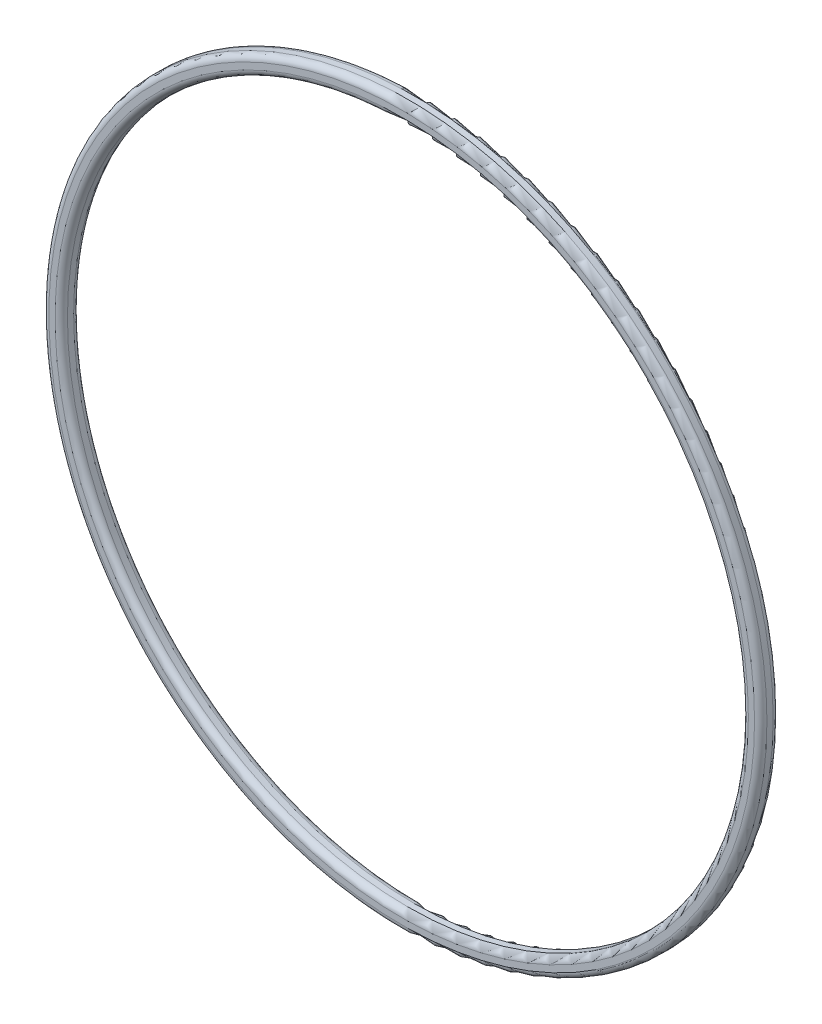
ISO-10303-21;
HEADER;
FILE_DESCRIPTION(('STEP AP214'),'2;1');
FILE_NAME('part.step','',(''),(''),'','','');
FILE_SCHEMA(('AUTOMOTIVE_DESIGN { 1 0 10303 214 1 1 1 1 }'));
ENDSEC;
DATA;
#1=APPLICATION_CONTEXT('core data for automotive mechanical design processes');
#2=APPLICATION_PROTOCOL_DEFINITION('international standard','automotive_design',2000,#1);
#3=PRODUCT_CONTEXT('',#1,'mechanical');
#4=PRODUCT('Part','Part','',(#3));
#5=PRODUCT_RELATED_PRODUCT_CATEGORY('part','',(#4));
#6=PRODUCT_DEFINITION_FORMATION('','',#4);
#7=PRODUCT_DEFINITION_CONTEXT('part definition',#1,'design');
#8=PRODUCT_DEFINITION('design','',#6,#7);
#9=PRODUCT_DEFINITION_SHAPE('','',#8);
#10=(LENGTH_UNIT() NAMED_UNIT(*) SI_UNIT(.MILLI.,.METRE.));
#11=(NAMED_UNIT(*) PLANE_ANGLE_UNIT() SI_UNIT($,.RADIAN.));
#12=(NAMED_UNIT(*) SI_UNIT($,.STERADIAN.) SOLID_ANGLE_UNIT());
#13=UNCERTAINTY_MEASURE_WITH_UNIT(LENGTH_MEASURE(1.E-05),#10,'distance_accuracy_value','');
#14=(GEOMETRIC_REPRESENTATION_CONTEXT(3) GLOBAL_UNCERTAINTY_ASSIGNED_CONTEXT((#13)) GLOBAL_UNIT_ASSIGNED_CONTEXT((#10,
#11,#12)) REPRESENTATION_CONTEXT('',''));
#15=CARTESIAN_POINT('',(0.,0.,0.));
#16=DIRECTION('',(0.,0.,1.));
#17=DIRECTION('',(1.,0.,0.));
#18=AXIS2_PLACEMENT_3D('',#15,#16,#17);
#19=CARTESIAN_POINT('',(0.,0.,3.));
#20=DIRECTION('',(0.,0.,1.));
#21=DIRECTION('',(1.,0.,0.));
#22=AXIS2_PLACEMENT_3D('',#19,#20,#21);
#23=PLANE('',#22);
#24=CARTESIAN_POINT('',(0.,0.,3.));
#25=DIRECTION('',(0.,0.,1.));
#26=DIRECTION('',(1.,0.,0.));
#27=AXIS2_PLACEMENT_3D('',#24,#25,#26);
#28=CIRCLE('',#27,56.);
#29=CARTESIAN_POINT('',(56.,0.,3.));
#30=VERTEX_POINT('',#29);
#31=EDGE_CURVE('E10',#30,#30,#28,.F.);
#32=ORIENTED_EDGE('',*,*,#31,.T.);
#33=EDGE_LOOP('',(#32));
#34=FACE_BOUND('',#33,.T.);
#35=CARTESIAN_POINT('',(0.,0.,3.));
#36=DIRECTION('',(0.,0.,1.));
#37=DIRECTION('',(1.,0.,0.));
#38=AXIS2_PLACEMENT_3D('',#35,#36,#37);
#39=CIRCLE('',#38,57.);
#40=CARTESIAN_POINT('',(57.,0.,3.));
#41=VERTEX_POINT('',#40);
#42=EDGE_CURVE('E41',#41,#41,#39,.T.);
#43=ORIENTED_EDGE('',*,*,#42,.T.);
#44=EDGE_LOOP('',(#43));
#45=FACE_BOUND('',#44,.T.);
#46=ADVANCED_FACE('F34',(#34,#45),#23,.T.);
#47=CARTESIAN_POINT('',(0.,0.,0.));
#48=DIRECTION('',(0.,0.,1.));
#49=DIRECTION('',(1.,0.,0.));
#50=AXIS2_PLACEMENT_3D('',#47,#48,#49);
#51=PLANE('',#50);
#52=CARTESIAN_POINT('',(0.,0.,0.));
#53=DIRECTION('',(0.,0.,1.));
#54=DIRECTION('',(1.,0.,0.));
#55=AXIS2_PLACEMENT_3D('',#52,#53,#54);
#56=CIRCLE('',#55,56.);
#57=CARTESIAN_POINT('',(56.,0.,0.));
#58=VERTEX_POINT('',#57);
#59=EDGE_CURVE('E60',#58,#58,#56,.T.);
#60=ORIENTED_EDGE('',*,*,#59,.T.);
#61=EDGE_LOOP('',(#60));
#62=FACE_BOUND('',#61,.T.);
#63=CARTESIAN_POINT('',(0.,0.,0.));
#64=DIRECTION('',(0.,0.,1.));
#65=DIRECTION('',(1.,0.,0.));
#66=AXIS2_PLACEMENT_3D('',#63,#64,#65);
#67=CIRCLE('',#66,57.);
#68=CARTESIAN_POINT('',(57.,0.,0.));
#69=VERTEX_POINT('',#68);
#70=EDGE_CURVE('E63',#69,#69,#67,.F.);
#71=ORIENTED_EDGE('',*,*,#70,.T.);
#72=EDGE_LOOP('',(#71));
#73=FACE_BOUND('',#72,.T.);
#74=ADVANCED_FACE('F67',(#62,#73),#51,.F.);
#75=CARTESIAN_POINT('',(0.,0.,3.));
#76=DIRECTION('',(0.,0.,-1.));
#77=DIRECTION('',(-1.,0.,0.));
#78=AXIS2_PLACEMENT_3D('',#75,#76,#77);
#79=CYLINDRICAL_SURFACE('',#78,58.);
#80=CARTESIAN_POINT('',(0.,0.,1.));
#81=DIRECTION('',(0.,0.,1.));
#82=DIRECTION('',(1.,0.,0.));
#83=AXIS2_PLACEMENT_3D('',#80,#81,#82);
#84=CIRCLE('',#83,58.);
#85=CARTESIAN_POINT('',(58.,0.,1.));
#86=VERTEX_POINT('',#85);
#87=EDGE_CURVE('E45',#86,#86,#84,.T.);
#88=ORIENTED_EDGE('',*,*,#87,.T.);
#89=EDGE_LOOP('',(#88));
#90=FACE_BOUND('',#89,.T.);
#91=CARTESIAN_POINT('',(0.,0.,2.));
#92=DIRECTION('',(0.,0.,1.));
#93=DIRECTION('',(1.,0.,0.));
#94=AXIS2_PLACEMENT_3D('',#91,#92,#93);
#95=CIRCLE('',#94,58.);
#96=CARTESIAN_POINT('',(58.,0.,2.));
#97=VERTEX_POINT('',#96);
#98=EDGE_CURVE('E49',#97,#97,#95,.F.);
#99=ORIENTED_EDGE('',*,*,#98,.T.);
#100=EDGE_LOOP('',(#99));
#101=FACE_BOUND('',#100,.T.);
#102=ADVANCED_FACE('F77',(#90,#101),#79,.T.);
#103=CARTESIAN_POINT('',(0.,0.,3.));
#104=DIRECTION('',(0.,0.,-1.));
#105=DIRECTION('',(-1.,0.,0.));
#106=AXIS2_PLACEMENT_3D('',#103,#104,#105);
#107=CYLINDRICAL_SURFACE('',#106,55.);
#108=CARTESIAN_POINT('',(0.,0.,1.));
#109=DIRECTION('',(0.,0.,1.));
#110=DIRECTION('',(1.,0.,0.));
#111=AXIS2_PLACEMENT_3D('',#108,#109,#110);
#112=CIRCLE('',#111,55.);
#113=CARTESIAN_POINT('',(55.,0.,1.));
#114=VERTEX_POINT('',#113);
#115=EDGE_CURVE('E54',#114,#114,#112,.F.);
#116=ORIENTED_EDGE('',*,*,#115,.T.);
#117=EDGE_LOOP('',(#116));
#118=FACE_BOUND('',#117,.T.);
#119=CARTESIAN_POINT('',(0.,0.,2.));
#120=DIRECTION('',(0.,0.,1.));
#121=DIRECTION('',(1.,0.,0.));
#122=AXIS2_PLACEMENT_3D('',#119,#120,#121);
#123=CIRCLE('',#122,55.);
#124=CARTESIAN_POINT('',(55.,0.,2.));
#125=VERTEX_POINT('',#124);
#126=EDGE_CURVE('E57',#125,#125,#123,.T.);
#127=ORIENTED_EDGE('',*,*,#126,.T.);
#128=EDGE_LOOP('',(#127));
#129=FACE_BOUND('',#128,.T.);
#130=ADVANCED_FACE('F80',(#118,#129),#107,.F.);
#131=CARTESIAN_POINT('',(0.,0.,1.));
#132=DIRECTION('',(0.,0.,1.));
#133=DIRECTION('',(1.,0.,0.));
#134=AXIS2_PLACEMENT_3D('',#131,#132,#133);
#135=TOROIDAL_SURFACE('',#134,56.,1.);
#136=ORIENTED_EDGE('',*,*,#115,.F.);
#137=EDGE_LOOP('',(#136));
#138=FACE_BOUND('',#137,.T.);
#139=ORIENTED_EDGE('',*,*,#59,.F.);
#140=EDGE_LOOP('',(#139));
#141=FACE_BOUND('',#140,.T.);
#142=ADVANCED_FACE('F73',(#138,#141),#135,.T.);
#143=CARTESIAN_POINT('',(0.,0.,1.));
#144=DIRECTION('',(0.,0.,1.));
#145=DIRECTION('',(1.,0.,0.));
#146=AXIS2_PLACEMENT_3D('',#143,#144,#145);
#147=TOROIDAL_SURFACE('',#146,57.,1.);
#148=ORIENTED_EDGE('',*,*,#70,.F.);
#149=EDGE_LOOP('',(#148));
#150=FACE_BOUND('',#149,.T.);
#151=ORIENTED_EDGE('',*,*,#87,.F.);
#152=EDGE_LOOP('',(#151));
#153=FACE_BOUND('',#152,.T.);
#154=ADVANCED_FACE('F69',(#150,#153),#147,.T.);
#155=CARTESIAN_POINT('',(0.,0.,2.));
#156=DIRECTION('',(0.,0.,1.));
#157=DIRECTION('',(1.,0.,0.));
#158=AXIS2_PLACEMENT_3D('',#155,#156,#157);
#159=TOROIDAL_SURFACE('',#158,56.,1.);
#160=ORIENTED_EDGE('',*,*,#31,.F.);
#161=EDGE_LOOP('',(#160));
#162=FACE_BOUND('',#161,.T.);
#163=ORIENTED_EDGE('',*,*,#126,.F.);
#164=EDGE_LOOP('',(#163));
#165=FACE_BOUND('',#164,.T.);
#166=ADVANCED_FACE('F72',(#162,#165),#159,.T.);
#167=CARTESIAN_POINT('',(0.,0.,2.));
#168=DIRECTION('',(0.,0.,1.));
#169=DIRECTION('',(1.,0.,0.));
#170=AXIS2_PLACEMENT_3D('',#167,#168,#169);
#171=TOROIDAL_SURFACE('',#170,57.,1.);
#172=ORIENTED_EDGE('',*,*,#98,.F.);
#173=EDGE_LOOP('',(#172));
#174=FACE_BOUND('',#173,.T.);
#175=ORIENTED_EDGE('',*,*,#42,.F.);
#176=EDGE_LOOP('',(#175));
#177=FACE_BOUND('',#176,.T.);
#178=ADVANCED_FACE('F36',(#174,#177),#171,.T.);
#179=CLOSED_SHELL('',(#46,#74,#102,#130,#142,#154,#166,#178));
#180=MANIFOLD_SOLID_BREP('B2',#179);
#181=ADVANCED_BREP_SHAPE_REPRESENTATION('',(#18,#180),#14);
#182=SHAPE_DEFINITION_REPRESENTATION(#9,#181);
ENDSEC;
END-ISO-10303-21;
